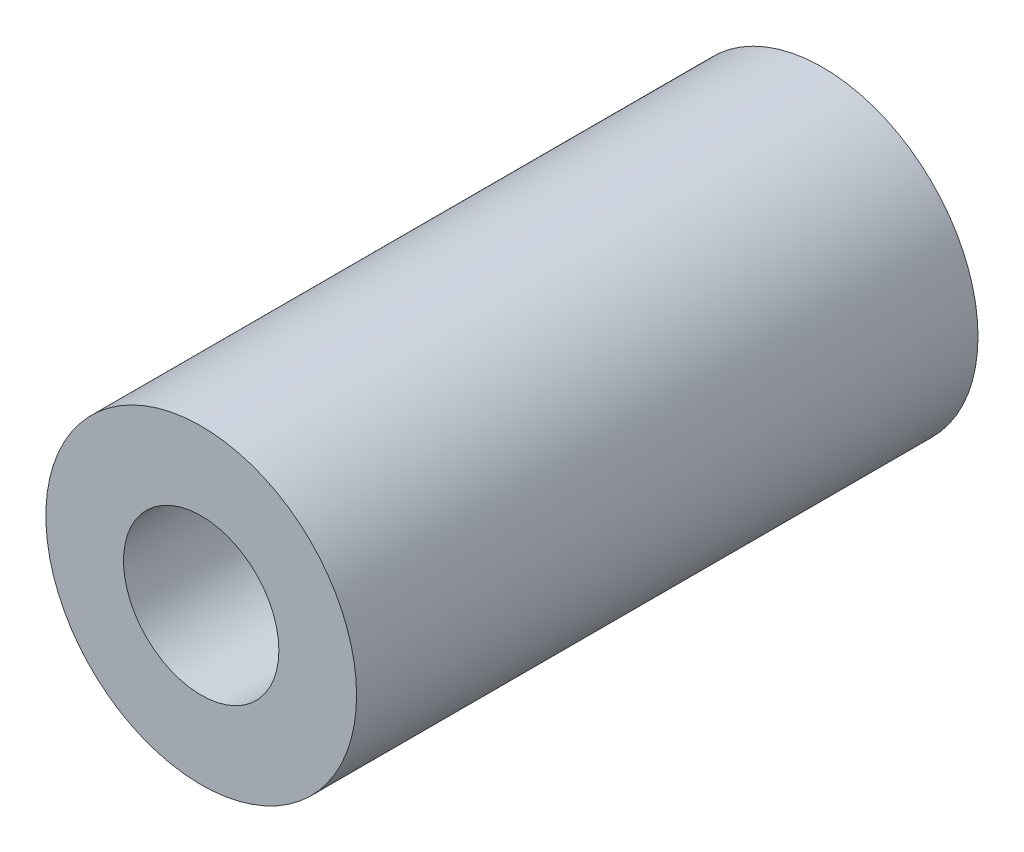
ISO-10303-21;
HEADER;
FILE_DESCRIPTION(('STEP AP214'),'2;1');
FILE_NAME('part.step','',(''),(''),'','','');
FILE_SCHEMA(('AUTOMOTIVE_DESIGN { 1 0 10303 214 1 1 1 1 }'));
ENDSEC;
DATA;
#1=APPLICATION_CONTEXT('core data for automotive mechanical design processes');
#2=APPLICATION_PROTOCOL_DEFINITION('international standard','automotive_design',2000,#1);
#3=PRODUCT_CONTEXT('',#1,'mechanical');
#4=PRODUCT('Part','Part','',(#3));
#5=PRODUCT_RELATED_PRODUCT_CATEGORY('part','',(#4));
#6=PRODUCT_DEFINITION_FORMATION('','',#4);
#7=PRODUCT_DEFINITION_CONTEXT('part definition',#1,'design');
#8=PRODUCT_DEFINITION('design','',#6,#7);
#9=PRODUCT_DEFINITION_SHAPE('','',#8);
#10=(LENGTH_UNIT() NAMED_UNIT(*) SI_UNIT(.MILLI.,.METRE.));
#11=(NAMED_UNIT(*) PLANE_ANGLE_UNIT() SI_UNIT($,.RADIAN.));
#12=(NAMED_UNIT(*) SI_UNIT($,.STERADIAN.) SOLID_ANGLE_UNIT());
#13=UNCERTAINTY_MEASURE_WITH_UNIT(LENGTH_MEASURE(1.E-05),#10,'distance_accuracy_value','');
#14=(GEOMETRIC_REPRESENTATION_CONTEXT(3) GLOBAL_UNCERTAINTY_ASSIGNED_CONTEXT((#13)) GLOBAL_UNIT_ASSIGNED_CONTEXT((#10,
#11,#12)) REPRESENTATION_CONTEXT('',''));
#15=CARTESIAN_POINT('',(0.,0.,0.));
#16=DIRECTION('',(0.,0.,1.));
#17=DIRECTION('',(1.,0.,0.));
#18=AXIS2_PLACEMENT_3D('',#15,#16,#17);
#19=CARTESIAN_POINT('',(0.,0.,200.));
#20=DIRECTION('',(0.,0.,-1.));
#21=DIRECTION('',(-1.,0.,0.));
#22=AXIS2_PLACEMENT_3D('',#19,#20,#21);
#23=CYLINDRICAL_SURFACE('',#22,50.);
#24=CARTESIAN_POINT('',(0.,0.,200.));
#25=DIRECTION('',(0.,0.,1.));
#26=DIRECTION('',(1.,0.,0.));
#27=AXIS2_PLACEMENT_3D('',#24,#25,#26);
#28=CIRCLE('',#27,50.);
#29=CARTESIAN_POINT('',(50.,0.,200.));
#30=VERTEX_POINT('',#29);
#31=EDGE_CURVE('E10',#30,#30,#28,.T.);
#32=ORIENTED_EDGE('',*,*,#31,.F.);
#33=EDGE_LOOP('',(#32));
#34=FACE_BOUND('',#33,.T.);
#35=CARTESIAN_POINT('',(0.,0.,0.));
#36=DIRECTION('',(0.,0.,1.));
#37=DIRECTION('',(1.,0.,0.));
#38=AXIS2_PLACEMENT_3D('',#35,#36,#37);
#39=CIRCLE('',#38,50.);
#40=CARTESIAN_POINT('',(50.,0.,0.));
#41=VERTEX_POINT('',#40);
#42=EDGE_CURVE('E50',#41,#41,#39,.T.);
#43=ORIENTED_EDGE('',*,*,#42,.T.);
#44=EDGE_LOOP('',(#43));
#45=FACE_BOUND('',#44,.T.);
#46=ADVANCED_FACE('F47',(#34,#45),#23,.T.);
#47=CARTESIAN_POINT('',(0.,0.,200.));
#48=DIRECTION('',(0.,0.,1.));
#49=DIRECTION('',(1.,0.,0.));
#50=AXIS2_PLACEMENT_3D('',#47,#48,#49);
#51=PLANE('',#50);
#52=CARTESIAN_POINT('',(0.,0.,200.));
#53=DIRECTION('',(0.,0.,1.));
#54=DIRECTION('',(1.,0.,0.));
#55=AXIS2_PLACEMENT_3D('',#52,#53,#54);
#56=CIRCLE('',#55,25.);
#57=CARTESIAN_POINT('',(25.,0.,200.));
#58=VERTEX_POINT('',#57);
#59=EDGE_CURVE('E61',#58,#58,#56,.T.);
#60=ORIENTED_EDGE('',*,*,#59,.F.);
#61=EDGE_LOOP('',(#60));
#62=FACE_BOUND('',#61,.T.);
#63=ORIENTED_EDGE('',*,*,#31,.T.);
#64=EDGE_LOOP('',(#63));
#65=FACE_BOUND('',#64,.T.);
#66=ADVANCED_FACE('F78',(#62,#65),#51,.T.);
#67=CARTESIAN_POINT('',(0.,0.,0.));
#68=DIRECTION('',(0.,0.,1.));
#69=DIRECTION('',(1.,0.,0.));
#70=AXIS2_PLACEMENT_3D('',#67,#68,#69);
#71=PLANE('',#70);
#72=CARTESIAN_POINT('',(0.,0.,0.));
#73=DIRECTION('',(0.,0.,1.));
#74=DIRECTION('',(1.,0.,0.));
#75=AXIS2_PLACEMENT_3D('',#72,#73,#74);
#76=CIRCLE('',#75,25.);
#77=CARTESIAN_POINT('',(25.,0.,0.));
#78=VERTEX_POINT('',#77);
#79=EDGE_CURVE('E59',#78,#78,#76,.T.);
#80=ORIENTED_EDGE('',*,*,#79,.T.);
#81=EDGE_LOOP('',(#80));
#82=FACE_BOUND('',#81,.T.);
#83=ORIENTED_EDGE('',*,*,#42,.F.);
#84=EDGE_LOOP('',(#83));
#85=FACE_BOUND('',#84,.T.);
#86=ADVANCED_FACE('F69',(#82,#85),#71,.F.);
#87=CARTESIAN_POINT('',(0.,0.,0.));
#88=DIRECTION('',(0.,0.,1.));
#89=DIRECTION('',(1.,0.,0.));
#90=AXIS2_PLACEMENT_3D('',#87,#88,#89);
#91=CYLINDRICAL_SURFACE('',#90,25.);
#92=ORIENTED_EDGE('',*,*,#79,.F.);
#93=EDGE_LOOP('',(#92));
#94=FACE_BOUND('',#93,.T.);
#95=ORIENTED_EDGE('',*,*,#59,.T.);
#96=EDGE_LOOP('',(#95));
#97=FACE_BOUND('',#96,.T.);
#98=ADVANCED_FACE('F72',(#94,#97),#91,.F.);
#99=CLOSED_SHELL('',(#46,#66,#86,#98));
#100=MANIFOLD_SOLID_BREP('B2',#99);
#101=ADVANCED_BREP_SHAPE_REPRESENTATION('',(#18,#100),#14);
#102=SHAPE_DEFINITION_REPRESENTATION(#9,#101);
ENDSEC;
END-ISO-10303-21;
